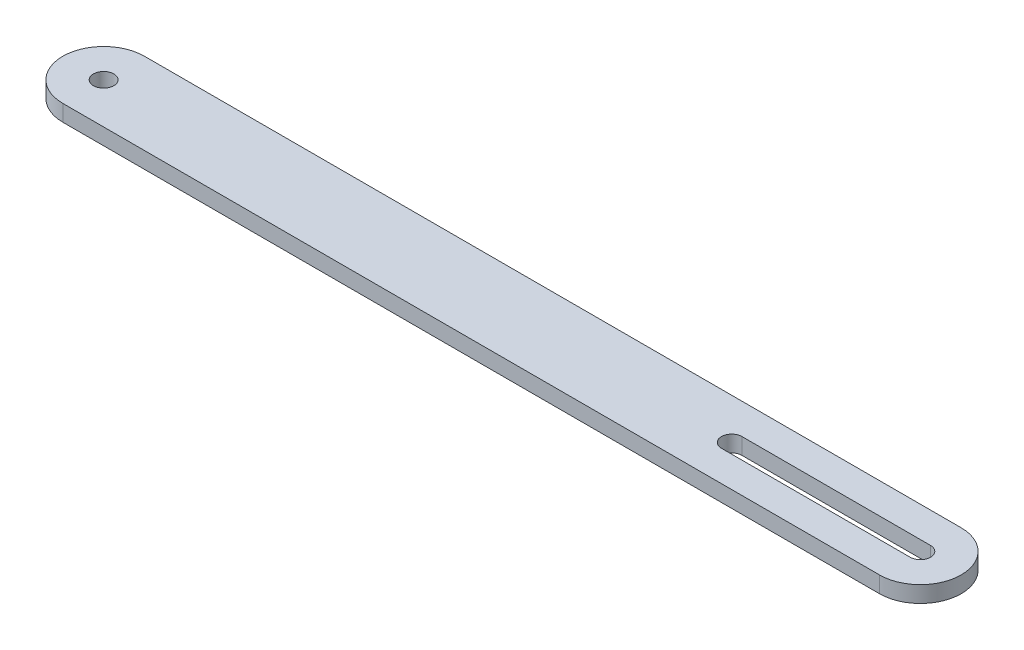
ISO-10303-21;
HEADER;
FILE_DESCRIPTION(('STEP AP214'),'2;1');
FILE_NAME('part.step','',(''),(''),'','','');
FILE_SCHEMA(('AUTOMOTIVE_DESIGN { 1 0 10303 214 1 1 1 1 }'));
ENDSEC;
DATA;
#1=APPLICATION_CONTEXT('core data for automotive mechanical design processes');
#2=APPLICATION_PROTOCOL_DEFINITION('international standard','automotive_design',2000,#1);
#3=PRODUCT_CONTEXT('',#1,'mechanical');
#4=PRODUCT('Part','Part','',(#3));
#5=PRODUCT_RELATED_PRODUCT_CATEGORY('part','',(#4));
#6=PRODUCT_DEFINITION_FORMATION('','',#4);
#7=PRODUCT_DEFINITION_CONTEXT('part definition',#1,'design');
#8=PRODUCT_DEFINITION('design','',#6,#7);
#9=PRODUCT_DEFINITION_SHAPE('','',#8);
#10=(LENGTH_UNIT() NAMED_UNIT(*) SI_UNIT(.MILLI.,.METRE.));
#11=(NAMED_UNIT(*) PLANE_ANGLE_UNIT() SI_UNIT($,.RADIAN.));
#12=(NAMED_UNIT(*) SI_UNIT($,.STERADIAN.) SOLID_ANGLE_UNIT());
#13=UNCERTAINTY_MEASURE_WITH_UNIT(LENGTH_MEASURE(1.E-05),#10,'distance_accuracy_value','');
#14=(GEOMETRIC_REPRESENTATION_CONTEXT(3) GLOBAL_UNCERTAINTY_ASSIGNED_CONTEXT((#13)) GLOBAL_UNIT_ASSIGNED_CONTEXT((#10,
#11,#12)) REPRESENTATION_CONTEXT('',''));
#15=CARTESIAN_POINT('',(0.,0.,0.));
#16=DIRECTION('',(0.,0.,1.));
#17=DIRECTION('',(1.,0.,0.));
#18=AXIS2_PLACEMENT_3D('',#15,#16,#17);
#19=CARTESIAN_POINT('',(0.,20.,50.));
#20=DIRECTION('',(0.,0.,-1.));
#21=DIRECTION('',(-1.,0.,0.));
#22=AXIS2_PLACEMENT_3D('',#19,#20,#21);
#23=PLANE('',#22);
#24=DIRECTION('',(1.,0.,0.));
#25=VECTOR('',#24,1.);
#26=CARTESIAN_POINT('',(0.,0.,50.));
#27=LINE('',#26,#25);
#28=CARTESIAN_POINT('',(-500.,0.,50.));
#29=VERTEX_POINT('',#28);
#30=CARTESIAN_POINT('',(500.,0.,50.));
#31=VERTEX_POINT('',#30);
#32=EDGE_CURVE('E147',#29,#31,#27,.T.);
#33=ORIENTED_EDGE('',*,*,#32,.T.);
#34=DIRECTION('',(0.,-1.,0.));
#35=VECTOR('',#34,1.);
#36=CARTESIAN_POINT('',(500.,20.,50.));
#37=LINE('',#36,#35);
#38=CARTESIAN_POINT('',(500.,20.,50.));
#39=VERTEX_POINT('',#38);
#40=EDGE_CURVE('E11',#39,#31,#37,.T.);
#41=ORIENTED_EDGE('',*,*,#40,.F.);
#42=DIRECTION('',(1.,0.,0.));
#43=VECTOR('',#42,1.);
#44=CARTESIAN_POINT('',(0.,20.,50.));
#45=LINE('',#44,#43);
#46=CARTESIAN_POINT('',(-500.,20.,50.));
#47=VERTEX_POINT('',#46);
#48=EDGE_CURVE('E115',#47,#39,#45,.T.);
#49=ORIENTED_EDGE('',*,*,#48,.F.);
#50=DIRECTION('',(0.,-1.,0.));
#51=VECTOR('',#50,1.);
#52=CARTESIAN_POINT('',(-500.,20.,50.));
#53=LINE('',#52,#51);
#54=EDGE_CURVE('E155',#47,#29,#53,.T.);
#55=ORIENTED_EDGE('',*,*,#54,.T.);
#56=EDGE_LOOP('',(#33,#41,#49,#55));
#57=FACE_BOUND('',#56,.T.);
#58=ADVANCED_FACE('F38',(#57),#23,.F.);
#59=CARTESIAN_POINT('',(500.,20.,0.));
#60=DIRECTION('',(0.,-1.,0.));
#61=DIRECTION('',(0.,0.,-1.));
#62=AXIS2_PLACEMENT_3D('',#59,#60,#61);
#63=CYLINDRICAL_SURFACE('',#62,50.);
#64=CARTESIAN_POINT('',(500.,0.,0.));
#65=DIRECTION('',(0.,1.,0.));
#66=DIRECTION('',(0.,0.,1.));
#67=AXIS2_PLACEMENT_3D('',#64,#65,#66);
#68=CIRCLE('',#67,50.);
#69=CARTESIAN_POINT('',(500.,0.,-50.));
#70=VERTEX_POINT('',#69);
#71=EDGE_CURVE('E121',#31,#70,#68,.T.);
#72=ORIENTED_EDGE('',*,*,#71,.T.);
#73=DIRECTION('',(0.,-1.,0.));
#74=VECTOR('',#73,1.);
#75=CARTESIAN_POINT('',(500.,20.,-50.));
#76=LINE('',#75,#74);
#77=CARTESIAN_POINT('',(500.,20.,-50.));
#78=VERTEX_POINT('',#77);
#79=EDGE_CURVE('E48',#78,#70,#76,.T.);
#80=ORIENTED_EDGE('',*,*,#79,.F.);
#81=CARTESIAN_POINT('',(500.,20.,0.));
#82=DIRECTION('',(0.,1.,0.));
#83=DIRECTION('',(0.,0.,1.));
#84=AXIS2_PLACEMENT_3D('',#81,#82,#83);
#85=CIRCLE('',#84,50.);
#86=EDGE_CURVE('E109',#39,#78,#85,.T.);
#87=ORIENTED_EDGE('',*,*,#86,.F.);
#88=ORIENTED_EDGE('',*,*,#40,.T.);
#89=EDGE_LOOP('',(#72,#80,#87,#88));
#90=FACE_BOUND('',#89,.T.);
#91=ADVANCED_FACE('F120',(#90),#63,.T.);
#92=CARTESIAN_POINT('',(0.,20.,-50.));
#93=DIRECTION('',(0.,0.,-1.));
#94=DIRECTION('',(-1.,0.,0.));
#95=AXIS2_PLACEMENT_3D('',#92,#93,#94);
#96=PLANE('',#95);
#97=DIRECTION('',(1.,0.,0.));
#98=VECTOR('',#97,1.);
#99=CARTESIAN_POINT('',(0.,0.,-50.));
#100=LINE('',#99,#98);
#101=CARTESIAN_POINT('',(-500.,0.,-50.));
#102=VERTEX_POINT('',#101);
#103=EDGE_CURVE('E151',#102,#70,#100,.T.);
#104=ORIENTED_EDGE('',*,*,#103,.F.);
#105=DIRECTION('',(0.,-1.,0.));
#106=VECTOR('',#105,1.);
#107=CARTESIAN_POINT('',(-500.,20.,-50.));
#108=LINE('',#107,#106);
#109=CARTESIAN_POINT('',(-500.,20.,-50.));
#110=VERTEX_POINT('',#109);
#111=EDGE_CURVE('E85',#110,#102,#108,.T.);
#112=ORIENTED_EDGE('',*,*,#111,.F.);
#113=DIRECTION('',(1.,0.,0.));
#114=VECTOR('',#113,1.);
#115=CARTESIAN_POINT('',(0.,20.,-50.));
#116=LINE('',#115,#114);
#117=EDGE_CURVE('E113',#110,#78,#116,.T.);
#118=ORIENTED_EDGE('',*,*,#117,.T.);
#119=ORIENTED_EDGE('',*,*,#79,.T.);
#120=EDGE_LOOP('',(#104,#112,#118,#119));
#121=FACE_BOUND('',#120,.T.);
#122=ADVANCED_FACE('F126',(#121),#96,.T.);
#123=CARTESIAN_POINT('',(269.,20.,0.));
#124=DIRECTION('',(0.,-1.,0.));
#125=DIRECTION('',(0.,0.,-1.));
#126=AXIS2_PLACEMENT_3D('',#123,#124,#125);
#127=CYLINDRICAL_SURFACE('',#126,12.4999999999995);
#128=CARTESIAN_POINT('',(269.,0.,0.));
#129=DIRECTION('',(0.,1.,0.));
#130=DIRECTION('',(0.,0.,1.));
#131=AXIS2_PLACEMENT_3D('',#128,#129,#130);
#132=CIRCLE('',#131,12.4999999999995);
#133=CARTESIAN_POINT('',(269.,0.,-12.5));
#134=VERTEX_POINT('',#133);
#135=CARTESIAN_POINT('',(269.,0.,12.5));
#136=VERTEX_POINT('',#135);
#137=EDGE_CURVE('E135',#134,#136,#132,.T.);
#138=ORIENTED_EDGE('',*,*,#137,.F.);
#139=DIRECTION('',(0.,-1.,0.));
#140=VECTOR('',#139,1.);
#141=CARTESIAN_POINT('',(269.,20.,-12.5));
#142=LINE('',#141,#140);
#143=CARTESIAN_POINT('',(269.,20.,-12.5));
#144=VERTEX_POINT('',#143);
#145=EDGE_CURVE('E42',#144,#134,#142,.T.);
#146=ORIENTED_EDGE('',*,*,#145,.F.);
#147=CARTESIAN_POINT('',(269.,20.,0.));
#148=DIRECTION('',(0.,1.,0.));
#149=DIRECTION('',(0.,0.,1.));
#150=AXIS2_PLACEMENT_3D('',#147,#148,#149);
#151=CIRCLE('',#150,12.4999999999995);
#152=CARTESIAN_POINT('',(269.,20.,12.5));
#153=VERTEX_POINT('',#152);
#154=EDGE_CURVE('E175',#144,#153,#151,.T.);
#155=ORIENTED_EDGE('',*,*,#154,.T.);
#156=DIRECTION('',(0.,-1.,0.));
#157=VECTOR('',#156,1.);
#158=CARTESIAN_POINT('',(269.,20.,12.5));
#159=LINE('',#158,#157);
#160=EDGE_CURVE('E128',#153,#136,#159,.T.);
#161=ORIENTED_EDGE('',*,*,#160,.T.);
#162=EDGE_LOOP('',(#138,#146,#155,#161));
#163=FACE_BOUND('',#162,.T.);
#164=ADVANCED_FACE('F174',(#163),#127,.F.);
#165=CARTESIAN_POINT('',(0.,20.,-12.5));
#166=DIRECTION('',(0.,0.,-1.));
#167=DIRECTION('',(-1.,0.,0.));
#168=AXIS2_PLACEMENT_3D('',#165,#166,#167);
#169=PLANE('',#168);
#170=DIRECTION('',(1.,0.,0.));
#171=VECTOR('',#170,1.);
#172=CARTESIAN_POINT('',(0.,0.,-12.5));
#173=LINE('',#172,#171);
#174=CARTESIAN_POINT('',(500.,0.,-12.5));
#175=VERTEX_POINT('',#174);
#176=EDGE_CURVE('E138',#134,#175,#173,.T.);
#177=ORIENTED_EDGE('',*,*,#176,.T.);
#178=DIRECTION('',(0.,-1.,0.));
#179=VECTOR('',#178,1.);
#180=CARTESIAN_POINT('',(500.,20.,-12.5));
#181=LINE('',#180,#179);
#182=CARTESIAN_POINT('',(500.,20.,-12.5));
#183=VERTEX_POINT('',#182);
#184=EDGE_CURVE('E160',#183,#175,#181,.T.);
#185=ORIENTED_EDGE('',*,*,#184,.F.);
#186=DIRECTION('',(1.,0.,0.));
#187=VECTOR('',#186,1.);
#188=CARTESIAN_POINT('',(0.,20.,-12.5));
#189=LINE('',#188,#187);
#190=EDGE_CURVE('E168',#144,#183,#189,.T.);
#191=ORIENTED_EDGE('',*,*,#190,.F.);
#192=ORIENTED_EDGE('',*,*,#145,.T.);
#193=EDGE_LOOP('',(#177,#185,#191,#192));
#194=FACE_BOUND('',#193,.T.);
#195=ADVANCED_FACE('F167',(#194),#169,.F.);
#196=CARTESIAN_POINT('',(500.,20.,0.));
#197=DIRECTION('',(0.,-1.,0.));
#198=DIRECTION('',(0.,0.,-1.));
#199=AXIS2_PLACEMENT_3D('',#196,#197,#198);
#200=CYLINDRICAL_SURFACE('',#199,12.5);
#201=CARTESIAN_POINT('',(500.,0.,0.));
#202=DIRECTION('',(0.,1.,0.));
#203=DIRECTION('',(0.,0.,1.));
#204=AXIS2_PLACEMENT_3D('',#201,#202,#203);
#205=CIRCLE('',#204,12.5);
#206=CARTESIAN_POINT('',(500.,0.,12.5));
#207=VERTEX_POINT('',#206);
#208=EDGE_CURVE('E141',#207,#175,#205,.T.);
#209=ORIENTED_EDGE('',*,*,#208,.F.);
#210=DIRECTION('',(0.,-1.,0.));
#211=VECTOR('',#210,1.);
#212=CARTESIAN_POINT('',(500.,20.,12.5));
#213=LINE('',#212,#211);
#214=CARTESIAN_POINT('',(500.,20.,12.5));
#215=VERTEX_POINT('',#214);
#216=EDGE_CURVE('E159',#215,#207,#213,.T.);
#217=ORIENTED_EDGE('',*,*,#216,.F.);
#218=CARTESIAN_POINT('',(500.,20.,0.));
#219=DIRECTION('',(0.,1.,0.));
#220=DIRECTION('',(0.,0.,1.));
#221=AXIS2_PLACEMENT_3D('',#218,#219,#220);
#222=CIRCLE('',#221,12.5);
#223=EDGE_CURVE('E215',#215,#183,#222,.T.);
#224=ORIENTED_EDGE('',*,*,#223,.T.);
#225=ORIENTED_EDGE('',*,*,#184,.T.);
#226=EDGE_LOOP('',(#209,#217,#224,#225));
#227=FACE_BOUND('',#226,.T.);
#228=ADVANCED_FACE('F182',(#227),#200,.F.);
#229=CARTESIAN_POINT('',(0.,20.,12.5));
#230=DIRECTION('',(0.,0.,-1.));
#231=DIRECTION('',(-1.,0.,0.));
#232=AXIS2_PLACEMENT_3D('',#229,#230,#231);
#233=PLANE('',#232);
#234=DIRECTION('',(1.,0.,0.));
#235=VECTOR('',#234,1.);
#236=CARTESIAN_POINT('',(0.,0.,12.5));
#237=LINE('',#236,#235);
#238=EDGE_CURVE('E144',#136,#207,#237,.T.);
#239=ORIENTED_EDGE('',*,*,#238,.F.);
#240=ORIENTED_EDGE('',*,*,#160,.F.);
#241=DIRECTION('',(1.,0.,0.));
#242=VECTOR('',#241,1.);
#243=CARTESIAN_POINT('',(0.,20.,12.5));
#244=LINE('',#243,#242);
#245=EDGE_CURVE('E180',#153,#215,#244,.T.);
#246=ORIENTED_EDGE('',*,*,#245,.T.);
#247=ORIENTED_EDGE('',*,*,#216,.T.);
#248=EDGE_LOOP('',(#239,#240,#246,#247));
#249=FACE_BOUND('',#248,.T.);
#250=ADVANCED_FACE('F179',(#249),#233,.T.);
#251=CARTESIAN_POINT('',(-500.,20.,0.));
#252=DIRECTION('',(0.,-1.,0.));
#253=DIRECTION('',(0.,0.,-1.));
#254=AXIS2_PLACEMENT_3D('',#251,#252,#253);
#255=CYLINDRICAL_SURFACE('',#254,12.5);
#256=CARTESIAN_POINT('',(-500.,20.,0.));
#257=DIRECTION('',(0.,1.,0.));
#258=DIRECTION('',(0.,0.,1.));
#259=AXIS2_PLACEMENT_3D('',#256,#257,#258);
#260=CIRCLE('',#259,12.5);
#261=CARTESIAN_POINT('',(-500.,20.,12.5));
#262=VERTEX_POINT('',#261);
#263=EDGE_CURVE('E154',#262,#262,#260,.T.);
#264=ORIENTED_EDGE('',*,*,#263,.T.);
#265=EDGE_LOOP('',(#264));
#266=FACE_BOUND('',#265,.T.);
#267=CARTESIAN_POINT('',(-500.,0.,0.));
#268=DIRECTION('',(0.,1.,0.));
#269=DIRECTION('',(0.,0.,1.));
#270=AXIS2_PLACEMENT_3D('',#267,#268,#269);
#271=CIRCLE('',#270,12.5);
#272=CARTESIAN_POINT('',(-500.,0.,12.5));
#273=VERTEX_POINT('',#272);
#274=EDGE_CURVE('E132',#273,#273,#271,.T.);
#275=ORIENTED_EDGE('',*,*,#274,.F.);
#276=EDGE_LOOP('',(#275));
#277=FACE_BOUND('',#276,.T.);
#278=ADVANCED_FACE('F40',(#266,#277),#255,.F.);
#279=CARTESIAN_POINT('',(-500.,20.,0.));
#280=DIRECTION('',(0.,-1.,0.));
#281=DIRECTION('',(0.,0.,-1.));
#282=AXIS2_PLACEMENT_3D('',#279,#280,#281);
#283=CYLINDRICAL_SURFACE('',#282,50.);
#284=CARTESIAN_POINT('',(-500.,0.,0.));
#285=DIRECTION('',(0.,1.,0.));
#286=DIRECTION('',(0.,0.,1.));
#287=AXIS2_PLACEMENT_3D('',#284,#285,#286);
#288=CIRCLE('',#287,50.);
#289=EDGE_CURVE('E88',#102,#29,#288,.T.);
#290=ORIENTED_EDGE('',*,*,#289,.T.);
#291=ORIENTED_EDGE('',*,*,#54,.F.);
#292=CARTESIAN_POINT('',(-500.,20.,0.));
#293=DIRECTION('',(0.,1.,0.));
#294=DIRECTION('',(0.,0.,1.));
#295=AXIS2_PLACEMENT_3D('',#292,#293,#294);
#296=CIRCLE('',#295,50.);
#297=EDGE_CURVE('E57',#110,#47,#296,.T.);
#298=ORIENTED_EDGE('',*,*,#297,.F.);
#299=ORIENTED_EDGE('',*,*,#111,.T.);
#300=EDGE_LOOP('',(#290,#291,#298,#299));
#301=FACE_BOUND('',#300,.T.);
#302=ADVANCED_FACE('F201',(#301),#283,.T.);
#303=CARTESIAN_POINT('',(0.,20.,0.));
#304=DIRECTION('',(0.,1.,0.));
#305=DIRECTION('',(0.,0.,1.));
#306=AXIS2_PLACEMENT_3D('',#303,#304,#305);
#307=PLANE('',#306);
#308=ORIENTED_EDGE('',*,*,#263,.F.);
#309=EDGE_LOOP('',(#308));
#310=FACE_BOUND('',#309,.T.);
#311=ORIENTED_EDGE('',*,*,#154,.F.);
#312=ORIENTED_EDGE('',*,*,#190,.T.);
#313=ORIENTED_EDGE('',*,*,#223,.F.);
#314=ORIENTED_EDGE('',*,*,#245,.F.);
#315=EDGE_LOOP('',(#311,#312,#313,#314));
#316=FACE_BOUND('',#315,.T.);
#317=ORIENTED_EDGE('',*,*,#48,.T.);
#318=ORIENTED_EDGE('',*,*,#86,.T.);
#319=ORIENTED_EDGE('',*,*,#117,.F.);
#320=ORIENTED_EDGE('',*,*,#297,.T.);
#321=EDGE_LOOP('',(#317,#318,#319,#320));
#322=FACE_BOUND('',#321,.T.);
#323=ADVANCED_FACE('F111',(#310,#316,#322),#307,.T.);
#324=CARTESIAN_POINT('',(0.,0.,0.));
#325=DIRECTION('',(0.,1.,0.));
#326=DIRECTION('',(0.,0.,1.));
#327=AXIS2_PLACEMENT_3D('',#324,#325,#326);
#328=PLANE('',#327);
#329=ORIENTED_EDGE('',*,*,#274,.T.);
#330=EDGE_LOOP('',(#329));
#331=FACE_BOUND('',#330,.T.);
#332=ORIENTED_EDGE('',*,*,#137,.T.);
#333=ORIENTED_EDGE('',*,*,#238,.T.);
#334=ORIENTED_EDGE('',*,*,#208,.T.);
#335=ORIENTED_EDGE('',*,*,#176,.F.);
#336=EDGE_LOOP('',(#332,#333,#334,#335));
#337=FACE_BOUND('',#336,.T.);
#338=ORIENTED_EDGE('',*,*,#32,.F.);
#339=ORIENTED_EDGE('',*,*,#289,.F.);
#340=ORIENTED_EDGE('',*,*,#103,.T.);
#341=ORIENTED_EDGE('',*,*,#71,.F.);
#342=EDGE_LOOP('',(#338,#339,#340,#341));
#343=FACE_BOUND('',#342,.T.);
#344=ADVANCED_FACE('F171',(#331,#337,#343),#328,.F.);
#345=CLOSED_SHELL('',(#58,#91,#122,#164,#195,#228,#250,#278,#302,#323,#344));
#346=MANIFOLD_SOLID_BREP('B2',#345);
#347=ADVANCED_BREP_SHAPE_REPRESENTATION('',(#18,#346),#14);
#348=SHAPE_DEFINITION_REPRESENTATION(#9,#347);
ENDSEC;
END-ISO-10303-21;
